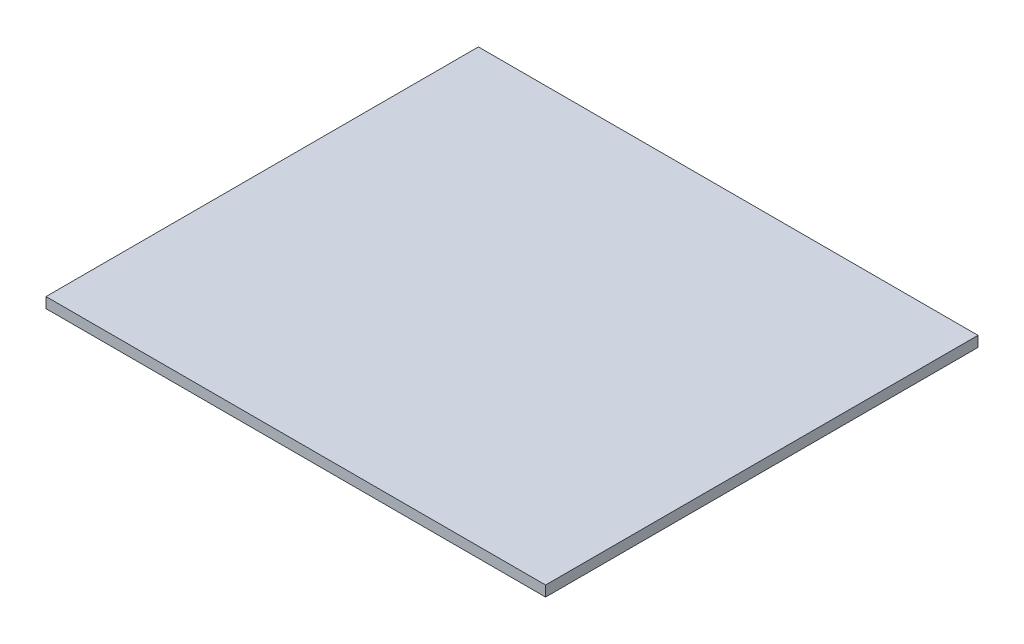
ISO-10303-21;
HEADER;
FILE_DESCRIPTION(('STEP AP214'),'2;1');
FILE_NAME('part.step','',(''),(''),'','','');
FILE_SCHEMA(('AUTOMOTIVE_DESIGN { 1 0 10303 214 1 1 1 1 }'));
ENDSEC;
DATA;
#1=APPLICATION_CONTEXT('core data for automotive mechanical design processes');
#2=APPLICATION_PROTOCOL_DEFINITION('international standard','automotive_design',2000,#1);
#3=PRODUCT_CONTEXT('',#1,'mechanical');
#4=PRODUCT('Part','Part','',(#3));
#5=PRODUCT_RELATED_PRODUCT_CATEGORY('part','',(#4));
#6=PRODUCT_DEFINITION_FORMATION('','',#4);
#7=PRODUCT_DEFINITION_CONTEXT('part definition',#1,'design');
#8=PRODUCT_DEFINITION('design','',#6,#7);
#9=PRODUCT_DEFINITION_SHAPE('','',#8);
#10=(LENGTH_UNIT() NAMED_UNIT(*) SI_UNIT(.MILLI.,.METRE.));
#11=(NAMED_UNIT(*) PLANE_ANGLE_UNIT() SI_UNIT($,.RADIAN.));
#12=(NAMED_UNIT(*) SI_UNIT($,.STERADIAN.) SOLID_ANGLE_UNIT());
#13=UNCERTAINTY_MEASURE_WITH_UNIT(LENGTH_MEASURE(1.E-05),#10,'distance_accuracy_value','');
#14=(GEOMETRIC_REPRESENTATION_CONTEXT(3) GLOBAL_UNCERTAINTY_ASSIGNED_CONTEXT((#13)) GLOBAL_UNIT_ASSIGNED_CONTEXT((#10,
#11,#12)) REPRESENTATION_CONTEXT('',''));
#15=CARTESIAN_POINT('',(0.,0.,0.));
#16=DIRECTION('',(0.,0.,1.));
#17=DIRECTION('',(1.,0.,0.));
#18=AXIS2_PLACEMENT_3D('',#15,#16,#17);
#19=CARTESIAN_POINT('',(59.5,2.5,51.5));
#20=DIRECTION('',(-1.,0.,0.));
#21=DIRECTION('',(0.,0.,1.));
#22=AXIS2_PLACEMENT_3D('',#19,#20,#21);
#23=PLANE('',#22);
#24=DIRECTION('',(0.,0.,-1.));
#25=VECTOR('',#24,1.);
#26=CARTESIAN_POINT('',(59.5,0.,51.5));
#27=LINE('',#26,#25);
#28=CARTESIAN_POINT('',(59.5,0.,51.5));
#29=VERTEX_POINT('',#28);
#30=CARTESIAN_POINT('',(59.5,0.,-51.5));
#31=VERTEX_POINT('',#30);
#32=EDGE_CURVE('E97',#29,#31,#27,.T.);
#33=ORIENTED_EDGE('',*,*,#32,.T.);
#34=DIRECTION('',(0.,-1.,0.));
#35=VECTOR('',#34,1.);
#36=CARTESIAN_POINT('',(59.5,2.5,-51.5));
#37=LINE('',#36,#35);
#38=CARTESIAN_POINT('',(59.5,2.5,-51.5));
#39=VERTEX_POINT('',#38);
#40=EDGE_CURVE('E11',#39,#31,#37,.T.);
#41=ORIENTED_EDGE('',*,*,#40,.F.);
#42=DIRECTION('',(0.,0.,-1.));
#43=VECTOR('',#42,1.);
#44=CARTESIAN_POINT('',(59.5,2.5,51.5));
#45=LINE('',#44,#43);
#46=CARTESIAN_POINT('',(59.5,2.5,51.5));
#47=VERTEX_POINT('',#46);
#48=EDGE_CURVE('E85',#47,#39,#45,.T.);
#49=ORIENTED_EDGE('',*,*,#48,.F.);
#50=DIRECTION('',(0.,-1.,0.));
#51=VECTOR('',#50,1.);
#52=CARTESIAN_POINT('',(59.5,2.5,51.5));
#53=LINE('',#52,#51);
#54=EDGE_CURVE('E93',#47,#29,#53,.T.);
#55=ORIENTED_EDGE('',*,*,#54,.T.);
#56=EDGE_LOOP('',(#33,#41,#49,#55));
#57=FACE_BOUND('',#56,.T.);
#58=ADVANCED_FACE('F34',(#57),#23,.F.);
#59=CARTESIAN_POINT('',(-59.5,2.5,-51.5));
#60=DIRECTION('',(0.,0.,1.));
#61=DIRECTION('',(1.,0.,0.));
#62=AXIS2_PLACEMENT_3D('',#59,#60,#61);
#63=PLANE('',#62);
#64=DIRECTION('',(-1.,0.,0.));
#65=VECTOR('',#64,1.);
#66=CARTESIAN_POINT('',(-59.5,0.,-51.5));
#67=LINE('',#66,#65);
#68=CARTESIAN_POINT('',(-59.5,0.,-51.5));
#69=VERTEX_POINT('',#68);
#70=EDGE_CURVE('E89',#31,#69,#67,.T.);
#71=ORIENTED_EDGE('',*,*,#70,.T.);
#72=DIRECTION('',(0.,-1.,0.));
#73=VECTOR('',#72,1.);
#74=CARTESIAN_POINT('',(-59.5,2.5,-51.5));
#75=LINE('',#74,#73);
#76=CARTESIAN_POINT('',(-59.5,2.5,-51.5));
#77=VERTEX_POINT('',#76);
#78=EDGE_CURVE('E42',#77,#69,#75,.T.);
#79=ORIENTED_EDGE('',*,*,#78,.F.);
#80=DIRECTION('',(-1.,0.,0.));
#81=VECTOR('',#80,1.);
#82=CARTESIAN_POINT('',(-59.5,2.5,-51.5));
#83=LINE('',#82,#81);
#84=EDGE_CURVE('E80',#39,#77,#83,.T.);
#85=ORIENTED_EDGE('',*,*,#84,.F.);
#86=ORIENTED_EDGE('',*,*,#40,.T.);
#87=EDGE_LOOP('',(#71,#79,#85,#86));
#88=FACE_BOUND('',#87,.T.);
#89=ADVANCED_FACE('F88',(#88),#63,.F.);
#90=CARTESIAN_POINT('',(-59.5,2.5,51.5));
#91=DIRECTION('',(1.,0.,0.));
#92=DIRECTION('',(0.,0.,-1.));
#93=AXIS2_PLACEMENT_3D('',#90,#91,#92);
#94=PLANE('',#93);
#95=DIRECTION('',(0.,0.,1.));
#96=VECTOR('',#95,1.);
#97=CARTESIAN_POINT('',(-59.5,0.,51.5));
#98=LINE('',#97,#96);
#99=CARTESIAN_POINT('',(-59.5,0.,51.5));
#100=VERTEX_POINT('',#99);
#101=EDGE_CURVE('E67',#69,#100,#98,.T.);
#102=ORIENTED_EDGE('',*,*,#101,.T.);
#103=DIRECTION('',(0.,-1.,0.));
#104=VECTOR('',#103,1.);
#105=CARTESIAN_POINT('',(-59.5,2.5,51.5));
#106=LINE('',#105,#104);
#107=CARTESIAN_POINT('',(-59.5,2.5,51.5));
#108=VERTEX_POINT('',#107);
#109=EDGE_CURVE('E90',#108,#100,#106,.T.);
#110=ORIENTED_EDGE('',*,*,#109,.F.);
#111=DIRECTION('',(0.,0.,1.));
#112=VECTOR('',#111,1.);
#113=CARTESIAN_POINT('',(-59.5,2.5,51.5));
#114=LINE('',#113,#112);
#115=EDGE_CURVE('E83',#77,#108,#114,.T.);
#116=ORIENTED_EDGE('',*,*,#115,.F.);
#117=ORIENTED_EDGE('',*,*,#78,.T.);
#118=EDGE_LOOP('',(#102,#110,#116,#117));
#119=FACE_BOUND('',#118,.T.);
#120=ADVANCED_FACE('F91',(#119),#94,.F.);
#121=CARTESIAN_POINT('',(-59.5,2.5,51.5));
#122=DIRECTION('',(0.,0.,-1.));
#123=DIRECTION('',(-1.,0.,0.));
#124=AXIS2_PLACEMENT_3D('',#121,#122,#123);
#125=PLANE('',#124);
#126=DIRECTION('',(1.,0.,0.));
#127=VECTOR('',#126,1.);
#128=CARTESIAN_POINT('',(-59.5,0.,51.5));
#129=LINE('',#128,#127);
#130=EDGE_CURVE('E73',#100,#29,#129,.T.);
#131=ORIENTED_EDGE('',*,*,#130,.T.);
#132=ORIENTED_EDGE('',*,*,#54,.F.);
#133=DIRECTION('',(1.,0.,0.));
#134=VECTOR('',#133,1.);
#135=CARTESIAN_POINT('',(-59.5,2.5,51.5));
#136=LINE('',#135,#134);
#137=EDGE_CURVE('E50',#108,#47,#136,.T.);
#138=ORIENTED_EDGE('',*,*,#137,.F.);
#139=ORIENTED_EDGE('',*,*,#109,.T.);
#140=EDGE_LOOP('',(#131,#132,#138,#139));
#141=FACE_BOUND('',#140,.T.);
#142=ADVANCED_FACE('F104',(#141),#125,.F.);
#143=CARTESIAN_POINT('',(0.,2.5,0.));
#144=DIRECTION('',(0.,-1.,0.));
#145=DIRECTION('',(0.,0.,-1.));
#146=AXIS2_PLACEMENT_3D('',#143,#144,#145);
#147=PLANE('',#146);
#148=ORIENTED_EDGE('',*,*,#48,.T.);
#149=ORIENTED_EDGE('',*,*,#84,.T.);
#150=ORIENTED_EDGE('',*,*,#115,.T.);
#151=ORIENTED_EDGE('',*,*,#137,.T.);
#152=EDGE_LOOP('',(#148,#149,#150,#151));
#153=FACE_BOUND('',#152,.T.);
#154=ADVANCED_FACE('F81',(#153),#147,.F.);
#155=CARTESIAN_POINT('',(0.,0.,0.));
#156=DIRECTION('',(0.,-1.,0.));
#157=DIRECTION('',(0.,0.,-1.));
#158=AXIS2_PLACEMENT_3D('',#155,#156,#157);
#159=PLANE('',#158);
#160=ORIENTED_EDGE('',*,*,#32,.F.);
#161=ORIENTED_EDGE('',*,*,#130,.F.);
#162=ORIENTED_EDGE('',*,*,#101,.F.);
#163=ORIENTED_EDGE('',*,*,#70,.F.);
#164=EDGE_LOOP('',(#160,#161,#162,#163));
#165=FACE_BOUND('',#164,.T.);
#166=ADVANCED_FACE('F107',(#165),#159,.T.);
#167=CLOSED_SHELL('',(#58,#89,#120,#142,#154,#166));
#168=MANIFOLD_SOLID_BREP('B2',#167);
#169=ADVANCED_BREP_SHAPE_REPRESENTATION('',(#18,#168),#14);
#170=SHAPE_DEFINITION_REPRESENTATION(#9,#169);
ENDSEC;
END-ISO-10303-21;
